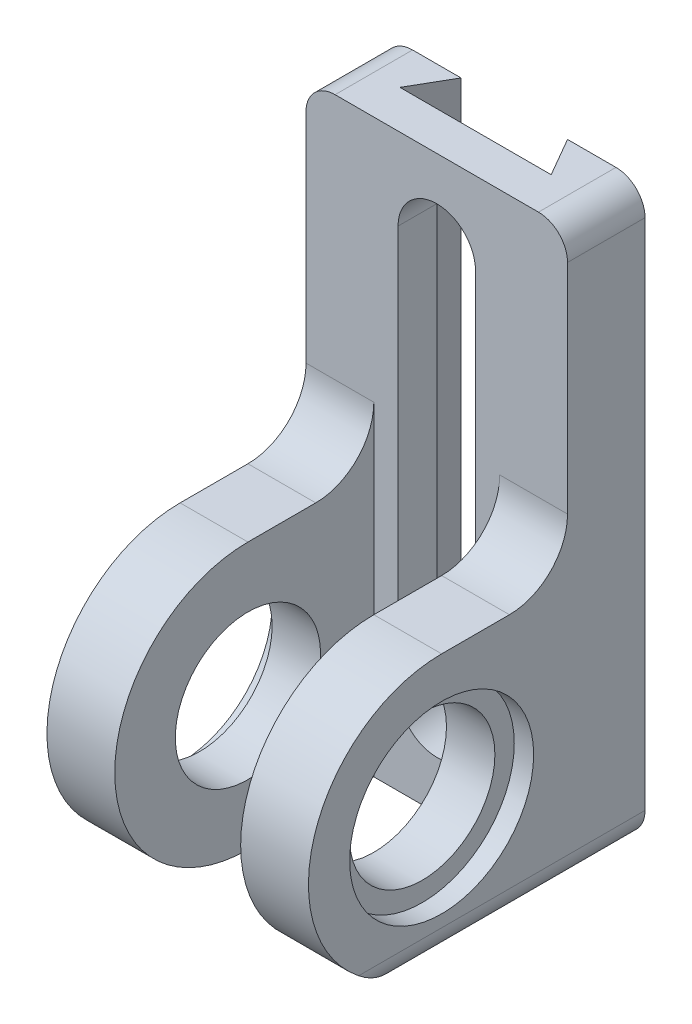
ISO-10303-21;
HEADER;
FILE_DESCRIPTION(('STEP AP214'),'2;1');
FILE_NAME('part.step','',(''),(''),'','','');
FILE_SCHEMA(('AUTOMOTIVE_DESIGN { 1 0 10303 214 1 1 1 1 }'));
ENDSEC;
DATA;
#1=APPLICATION_CONTEXT('core data for automotive mechanical design processes');
#2=APPLICATION_PROTOCOL_DEFINITION('international standard','automotive_design',2000,#1);
#3=PRODUCT_CONTEXT('',#1,'mechanical');
#4=PRODUCT('Part','Part','',(#3));
#5=PRODUCT_RELATED_PRODUCT_CATEGORY('part','',(#4));
#6=PRODUCT_DEFINITION_FORMATION('','',#4);
#7=PRODUCT_DEFINITION_CONTEXT('part definition',#1,'design');
#8=PRODUCT_DEFINITION('design','',#6,#7);
#9=PRODUCT_DEFINITION_SHAPE('','',#8);
#10=(LENGTH_UNIT() NAMED_UNIT(*) SI_UNIT(.MILLI.,.METRE.));
#11=(NAMED_UNIT(*) PLANE_ANGLE_UNIT() SI_UNIT($,.RADIAN.));
#12=(NAMED_UNIT(*) SI_UNIT($,.STERADIAN.) SOLID_ANGLE_UNIT());
#13=UNCERTAINTY_MEASURE_WITH_UNIT(LENGTH_MEASURE(1.E-05),#10,'distance_accuracy_value','');
#14=(GEOMETRIC_REPRESENTATION_CONTEXT(3) GLOBAL_UNCERTAINTY_ASSIGNED_CONTEXT((#13)) GLOBAL_UNIT_ASSIGNED_CONTEXT((#10,
#11,#12)) REPRESENTATION_CONTEXT('',''));
#15=CARTESIAN_POINT('',(0.,0.,0.));
#16=DIRECTION('',(0.,0.,1.));
#17=DIRECTION('',(1.,0.,0.));
#18=AXIS2_PLACEMENT_3D('',#15,#16,#17);
#19=CARTESIAN_POINT('',(-27.,118.,0.));
#20=DIRECTION('',(0.,0.,-1.));
#21=DIRECTION('',(0.,1.,0.));
#22=AXIS2_PLACEMENT_3D('',#19,#20,#21);
#23=PLANE('',#22);
#24=DIRECTION('',(1.,0.,0.));
#25=VECTOR('',#24,1.);
#26=CARTESIAN_POINT('',(-27.,118.,0.));
#27=LINE('',#26,#25);
#28=CARTESIAN_POINT('',(-16.,118.,0.));
#29=VERTEX_POINT('',#28);
#30=CARTESIAN_POINT('',(-6.,118.,0.));
#31=VERTEX_POINT('',#30);
#32=EDGE_CURVE('E361',#29,#31,#27,.T.);
#33=ORIENTED_EDGE('',*,*,#32,.T.);
#34=CARTESIAN_POINT('',(-6.,112.,0.));
#35=DIRECTION('',(0.,0.,-1.));
#36=DIRECTION('',(0.,1.,0.));
#37=AXIS2_PLACEMENT_3D('',#34,#35,#36);
#38=CIRCLE('',#37,6.);
#39=CARTESIAN_POINT('',(0.,112.,0.));
#40=VERTEX_POINT('',#39);
#41=EDGE_CURVE('E447',#31,#40,#38,.T.);
#42=ORIENTED_EDGE('',*,*,#41,.T.);
#43=DIRECTION('',(0.,1.,0.));
#44=VECTOR('',#43,1.);
#45=CARTESIAN_POINT('',(0.,118.,0.));
#46=LINE('',#45,#44);
#47=CARTESIAN_POINT('',(0.,6.00000000000001,0.));
#48=VERTEX_POINT('',#47);
#49=EDGE_CURVE('E347',#48,#40,#46,.T.);
#50=ORIENTED_EDGE('',*,*,#49,.F.);
#51=CARTESIAN_POINT('',(-6.,6.,0.));
#52=DIRECTION('',(0.,0.,-1.));
#53=DIRECTION('',(0.,1.,0.));
#54=AXIS2_PLACEMENT_3D('',#51,#52,#53);
#55=CIRCLE('',#54,6.);
#56=CARTESIAN_POINT('',(-6.,0.,0.));
#57=VERTEX_POINT('',#56);
#58=EDGE_CURVE('E397',#48,#57,#55,.T.);
#59=ORIENTED_EDGE('',*,*,#58,.T.);
#60=DIRECTION('',(1.,0.,0.));
#61=VECTOR('',#60,1.);
#62=CARTESIAN_POINT('',(-27.,0.,0.));
#63=LINE('',#62,#61);
#64=CARTESIAN_POINT('',(-16.,0.,0.));
#65=VERTEX_POINT('',#64);
#66=EDGE_CURVE('E362',#65,#57,#63,.T.);
#67=ORIENTED_EDGE('',*,*,#66,.F.);
#68=DIRECTION('',(0.,1.,0.));
#69=VECTOR('',#68,1.);
#70=CARTESIAN_POINT('',(-16.,-174.478016165361,0.));
#71=LINE('',#70,#69);
#72=EDGE_CURVE('E315',#65,#29,#71,.T.);
#73=ORIENTED_EDGE('',*,*,#72,.T.);
#74=EDGE_LOOP('',(#33,#42,#50,#59,#67,#73));
#75=FACE_BOUND('',#74,.T.);
#76=ADVANCED_FACE('F43',(#75),#23,.T.);
#77=CARTESIAN_POINT('',(-27.,0.,0.));
#78=DIRECTION('',(0.,-1.,0.));
#79=DIRECTION('',(0.,0.,-1.));
#80=AXIS2_PLACEMENT_3D('',#77,#78,#79);
#81=PLANE('',#80);
#82=DIRECTION('',(-1.,0.,0.));
#83=VECTOR('',#82,1.);
#84=CARTESIAN_POINT('',(-27.,0.,42.));
#85=LINE('',#84,#83);
#86=CARTESIAN_POINT('',(-40.,0.,42.));
#87=VERTEX_POINT('',#86);
#88=CARTESIAN_POINT('',(-48.,0.,42.));
#89=VERTEX_POINT('',#88);
#90=EDGE_CURVE('E295',#87,#89,#85,.T.);
#91=ORIENTED_EDGE('',*,*,#90,.T.);
#92=DIRECTION('',(0.,0.,-1.));
#93=VECTOR('',#92,1.);
#94=CARTESIAN_POINT('',(-48.,0.,0.));
#95=LINE('',#94,#93);
#96=CARTESIAN_POINT('',(-48.,0.,0.));
#97=VERTEX_POINT('',#96);
#98=EDGE_CURVE('E57',#89,#97,#95,.T.);
#99=ORIENTED_EDGE('',*,*,#98,.T.);
#100=DIRECTION('',(-1.,0.,0.));
#101=VECTOR('',#100,1.);
#102=CARTESIAN_POINT('',(-27.,0.,0.));
#103=LINE('',#102,#101);
#104=CARTESIAN_POINT('',(-38.,0.,0.));
#105=VERTEX_POINT('',#104);
#106=EDGE_CURVE('E291',#105,#97,#103,.T.);
#107=ORIENTED_EDGE('',*,*,#106,.F.);
#108=DIRECTION('',(0.499999999999998,0.,-0.86602540378444));
#109=VECTOR('',#108,1.);
#110=CARTESIAN_POINT('',(-35.25,0.,-4.7631397208144));
#111=LINE('',#110,#109);
#112=CARTESIAN_POINT('',(-42.618802153517,0.,8.));
#113=VERTEX_POINT('',#112);
#114=EDGE_CURVE('E252',#113,#105,#111,.T.);
#115=ORIENTED_EDGE('',*,*,#114,.F.);
#116=DIRECTION('',(1.,0.,0.));
#117=VECTOR('',#116,1.);
#118=CARTESIAN_POINT('',(-27.,0.,8.));
#119=LINE('',#118,#117);
#120=CARTESIAN_POINT('',(-11.381197846483,0.,8.));
#121=VERTEX_POINT('',#120);
#122=EDGE_CURVE('E318',#113,#121,#119,.T.);
#123=ORIENTED_EDGE('',*,*,#122,.T.);
#124=DIRECTION('',(-0.499999999999998,0.,-0.86602540378444));
#125=VECTOR('',#124,1.);
#126=CARTESIAN_POINT('',(-18.75,0.,-4.7631397208144));
#127=LINE('',#126,#125);
#128=EDGE_CURVE('E321',#121,#65,#127,.T.);
#129=ORIENTED_EDGE('',*,*,#128,.T.);
#130=ORIENTED_EDGE('',*,*,#66,.T.);
#131=DIRECTION('',(0.,0.,-1.));
#132=VECTOR('',#131,1.);
#133=CARTESIAN_POINT('',(-6.,0.,42.));
#134=LINE('',#133,#132);
#135=CARTESIAN_POINT('',(-6.,0.,42.));
#136=VERTEX_POINT('',#135);
#137=EDGE_CURVE('E399',#57,#136,#134,.F.);
#138=ORIENTED_EDGE('',*,*,#137,.T.);
#139=DIRECTION('',(1.,0.,0.));
#140=VECTOR('',#139,1.);
#141=CARTESIAN_POINT('',(-27.,0.,42.));
#142=LINE('',#141,#140);
#143=CARTESIAN_POINT('',(-14.,0.,42.));
#144=VERTEX_POINT('',#143);
#145=EDGE_CURVE('E366',#144,#136,#142,.T.);
#146=ORIENTED_EDGE('',*,*,#145,.F.);
#147=DIRECTION('',(0.,0.,1.));
#148=VECTOR('',#147,1.);
#149=CARTESIAN_POINT('',(-14.,0.,69.5));
#150=LINE('',#149,#148);
#151=CARTESIAN_POINT('',(-14.,0.,16.));
#152=VERTEX_POINT('',#151);
#153=EDGE_CURVE('E327',#152,#144,#150,.T.);
#154=ORIENTED_EDGE('',*,*,#153,.F.);
#155=DIRECTION('',(1.,0.,0.));
#156=VECTOR('',#155,1.);
#157=CARTESIAN_POINT('',(-14.,0.,16.));
#158=LINE('',#157,#156);
#159=CARTESIAN_POINT('',(-40.,0.,16.));
#160=VERTEX_POINT('',#159);
#161=EDGE_CURVE('E324',#160,#152,#158,.T.);
#162=ORIENTED_EDGE('',*,*,#161,.F.);
#163=DIRECTION('',(0.,0.,1.));
#164=VECTOR('',#163,1.);
#165=CARTESIAN_POINT('',(-40.,0.,69.5));
#166=LINE('',#165,#164);
#167=EDGE_CURVE('E254',#160,#87,#166,.T.);
#168=ORIENTED_EDGE('',*,*,#167,.T.);
#169=EDGE_LOOP('',(#91,#99,#107,#115,#123,#129,#130,#138,#146,#154,#162,#168));
#170=FACE_BOUND('',#169,.T.);
#171=ADVANCED_FACE('F423',(#170),#81,.T.);
#172=CARTESIAN_POINT('',(-27.,118.,16.));
#173=DIRECTION('',(0.,1.,0.));
#174=DIRECTION('',(0.,0.,1.));
#175=AXIS2_PLACEMENT_3D('',#172,#173,#174);
#176=PLANE('',#175);
#177=DIRECTION('',(1.,0.,0.));
#178=VECTOR('',#177,1.);
#179=CARTESIAN_POINT('',(-27.,118.,16.));
#180=LINE('',#179,#178);
#181=CARTESIAN_POINT('',(-48.,118.,16.));
#182=VERTEX_POINT('',#181);
#183=CARTESIAN_POINT('',(-6.,118.,16.));
#184=VERTEX_POINT('',#183);
#185=EDGE_CURVE('E376',#182,#184,#180,.T.);
#186=ORIENTED_EDGE('',*,*,#185,.T.);
#187=DIRECTION('',(0.,0.,1.));
#188=VECTOR('',#187,1.);
#189=CARTESIAN_POINT('',(-6.,118.,0.));
#190=LINE('',#189,#188);
#191=EDGE_CURVE('E453',#184,#31,#190,.F.);
#192=ORIENTED_EDGE('',*,*,#191,.T.);
#193=ORIENTED_EDGE('',*,*,#32,.F.);
#194=DIRECTION('',(0.499999999999998,0.,0.86602540378444));
#195=VECTOR('',#194,1.);
#196=CARTESIAN_POINT('',(-11.8217967697245,118.,7.23686027918564));
#197=LINE('',#196,#195);
#198=CARTESIAN_POINT('',(-11.381197846483,118.,8.));
#199=VERTEX_POINT('',#198);
#200=EDGE_CURVE('E384',#29,#199,#197,.T.);
#201=ORIENTED_EDGE('',*,*,#200,.T.);
#202=DIRECTION('',(-1.,0.,0.));
#203=VECTOR('',#202,1.);
#204=CARTESIAN_POINT('',(-27.,118.,8.));
#205=LINE('',#204,#203);
#206=CARTESIAN_POINT('',(-42.618802153517,118.,8.));
#207=VERTEX_POINT('',#206);
#208=EDGE_CURVE('E365',#199,#207,#205,.T.);
#209=ORIENTED_EDGE('',*,*,#208,.T.);
#210=DIRECTION('',(-0.499999999999998,0.,0.86602540378444));
#211=VECTOR('',#210,1.);
#212=CARTESIAN_POINT('',(-42.1782032302755,118.,7.23686027918564));
#213=LINE('',#212,#211);
#214=CARTESIAN_POINT('',(-38.,118.,0.));
#215=VERTEX_POINT('',#214);
#216=EDGE_CURVE('E294',#215,#207,#213,.T.);
#217=ORIENTED_EDGE('',*,*,#216,.F.);
#218=DIRECTION('',(-1.,0.,0.));
#219=VECTOR('',#218,1.);
#220=CARTESIAN_POINT('',(-27.,118.,0.));
#221=LINE('',#220,#219);
#222=CARTESIAN_POINT('',(-48.,118.,0.));
#223=VERTEX_POINT('',#222);
#224=EDGE_CURVE('E290',#215,#223,#221,.T.);
#225=ORIENTED_EDGE('',*,*,#224,.T.);
#226=DIRECTION('',(0.,0.,1.));
#227=VECTOR('',#226,1.);
#228=CARTESIAN_POINT('',(-48.,118.,16.));
#229=LINE('',#228,#227);
#230=EDGE_CURVE('E459',#223,#182,#229,.T.);
#231=ORIENTED_EDGE('',*,*,#230,.T.);
#232=EDGE_LOOP('',(#186,#192,#193,#201,#209,#217,#225,#231));
#233=FACE_BOUND('',#232,.T.);
#234=ADVANCED_FACE('F421',(#233),#176,.T.);
#235=CARTESIAN_POINT('',(-27.,27.5,42.));
#236=DIRECTION('',(1.,0.,0.));
#237=DIRECTION('',(0.,0.,-1.));
#238=AXIS2_PLACEMENT_3D('',#235,#236,#237);
#239=CYLINDRICAL_SURFACE('',#238,27.5);
#240=ORIENTED_EDGE('',*,*,#145,.T.);
#241=CARTESIAN_POINT('',(0.,6.,59.1464281994822));
#242=CARTESIAN_POINT('',(-1.19597853242227E-05,5.86323878730196,58.97495101779));
#243=CARTESIAN_POINT('',(-0.00467529896430748,5.72855872475506,58.8018582369554));
#244=CARTESIAN_POINT('',(-0.0225463443197351,5.46361802526845,58.452834998014));
#245=CARTESIAN_POINT('',(-0.0357513908478061,5.33335602595039,58.2769054398211));
#246=CARTESIAN_POINT('',(-0.0699166637892913,5.07766075818884,57.9228239978805));
#247=CARTESIAN_POINT('',(-0.0908624469045142,4.95221897400261,57.7446768463461));
#248=CARTESIAN_POINT('',(-0.139845304495458,4.7060380923147,57.386117357111));
#249=CARTESIAN_POINT('',(-0.167882996086804,4.58529940511743,57.2057048235829));
#250=CARTESIAN_POINT('',(-0.261235831958719,4.23204791656502,56.664146734316));
#251=CARTESIAN_POINT('',(-0.336067969836736,4.00657026723381,56.3000046090538));
#252=CARTESIAN_POINT('',(-0.50707465599253,3.57477229467483,55.5652233098904));
#253=CARTESIAN_POINT('',(-0.603263251076297,3.36846470746709,55.1945800084232));
#254=CARTESIAN_POINT('',(-0.792760824505874,3.01391692878088,54.5218370608529));
#255=CARTESIAN_POINT('',(-0.882896203650564,2.86224929687171,54.2206361009054));
#256=CARTESIAN_POINT('',(-1.0731676129327,2.57121844152793,53.615447460908));
#257=CARTESIAN_POINT('',(-1.17330479950031,2.43185664443787,53.3114594623136));
#258=CARTESIAN_POINT('',(-1.48672752247981,2.03197840283151,52.3958418830382));
#259=CARTESIAN_POINT('',(-1.71301181640983,1.78969154316575,51.7806014822474));
#260=CARTESIAN_POINT('',(-2.19231972925325,1.35162094120064,50.5408760535597));
#261=CARTESIAN_POINT('',(-2.44545564583231,1.15604458925087,49.9163624120902));
#262=CARTESIAN_POINT('',(-2.97062201326019,0.811410038835711,48.6627024223054));
#263=CARTESIAN_POINT('',(-3.24264750501392,0.66233968713846,48.0335573283739));
#264=CARTESIAN_POINT('',(-3.71830265792247,0.446562752839289,46.956668199771));
#265=CARTESIAN_POINT('',(-3.91865814130805,0.368519014404475,46.5097049741419));
#266=CARTESIAN_POINT('',(-4.32417105559603,0.234829391350376,45.6145977867268));
#267=CARTESIAN_POINT('',(-4.52932911350089,0.179186448729744,45.1664536776244));
#268=CARTESIAN_POINT('',(-5.14852764470595,0.0457593390690001,43.8229802428915));
#269=CARTESIAN_POINT('',(-5.56737808048158,0.000995422478633021,42.9261891461037));
#270=CARTESIAN_POINT('',(-5.99064257321795,5.47503479598994E-06,42.0200330593041));
#271=CARTESIAN_POINT('',(-5.99532130781622,2.54524829043168E-09,42.0100164871249));
#272=CARTESIAN_POINT('',(-6.,0.,42.));
#273=B_SPLINE_CURVE_WITH_KNOTS('',3,(#241,#242,#243,#244,#245,#246,#247,#248,#249,#250,#251,
#252,#253,#254,#255,#256,#257,#258,#259,#260,#261,#262,#263,#264,#265,#266,#267,#268,#269,#270,
#271,#272),.UNSPECIFIED.,.F.,.F.,(4,2,2,2,2,2,2,2,2,2,2,2,2,2,2,4),(0.,0.657890898774864,
1.31557704729753,1.97204217668188,2.62856444926567,3.93170367743565,5.23570257337212,
6.28251967573983,7.32945795373697,9.42348355749168,11.5266404473413,13.6292472661182,
15.1166915318322,16.6043310867035,19.5715482270689,19.604714479038),.UNSPECIFIED.);
#274=CARTESIAN_POINT('',(0.,6.,59.1464281994822));
#275=VERTEX_POINT('',#274);
#276=EDGE_CURVE('E401',#136,#275,#273,.F.);
#277=ORIENTED_EDGE('',*,*,#276,.T.);
#278=CARTESIAN_POINT('',(0.,27.5,42.));
#279=DIRECTION('',(1.,0.,0.));
#280=DIRECTION('',(0.,0.,1.));
#281=AXIS2_PLACEMENT_3D('',#278,#279,#280);
#282=CIRCLE('',#281,27.5);
#283=CARTESIAN_POINT('',(0.,55.,42.));
#284=VERTEX_POINT('',#283);
#285=EDGE_CURVE('E358',#284,#275,#282,.T.);
#286=ORIENTED_EDGE('',*,*,#285,.F.);
#287=DIRECTION('',(1.,0.,0.));
#288=VECTOR('',#287,1.);
#289=CARTESIAN_POINT('',(-27.,55.,42.));
#290=LINE('',#289,#288);
#291=CARTESIAN_POINT('',(-14.,55.,42.));
#292=VERTEX_POINT('',#291);
#293=EDGE_CURVE('E369',#292,#284,#290,.T.);
#294=ORIENTED_EDGE('',*,*,#293,.F.);
#295=CARTESIAN_POINT('',(-14.,27.5,42.));
#296=DIRECTION('',(1.,0.,0.));
#297=DIRECTION('',(0.,0.,-1.));
#298=AXIS2_PLACEMENT_3D('',#295,#296,#297);
#299=CIRCLE('',#298,27.5);
#300=EDGE_CURVE('E336',#144,#292,#299,.F.);
#301=ORIENTED_EDGE('',*,*,#300,.F.);
#302=EDGE_LOOP('',(#240,#277,#286,#294,#301));
#303=FACE_BOUND('',#302,.T.);
#304=ADVANCED_FACE('F415',(#303),#239,.T.);
#305=CARTESIAN_POINT('',(-27.,55.,42.));
#306=DIRECTION('',(0.,1.,0.));
#307=DIRECTION('',(0.,0.,1.));
#308=AXIS2_PLACEMENT_3D('',#305,#306,#307);
#309=PLANE('',#308);
#310=DIRECTION('',(0.,0.,-1.));
#311=VECTOR('',#310,1.);
#312=CARTESIAN_POINT('',(-14.,55.,42.));
#313=LINE('',#312,#311);
#314=CARTESIAN_POINT('',(-14.,55.,28.0000000000001));
#315=VERTEX_POINT('',#314);
#316=EDGE_CURVE('E334',#292,#315,#313,.T.);
#317=ORIENTED_EDGE('',*,*,#316,.F.);
#318=ORIENTED_EDGE('',*,*,#293,.T.);
#319=DIRECTION('',(0.,0.,1.));
#320=VECTOR('',#319,1.);
#321=CARTESIAN_POINT('',(0.,55.,42.));
#322=LINE('',#321,#320);
#323=CARTESIAN_POINT('',(0.,55.,28.0000000000001));
#324=VERTEX_POINT('',#323);
#325=EDGE_CURVE('E355',#324,#284,#322,.T.);
#326=ORIENTED_EDGE('',*,*,#325,.F.);
#327=DIRECTION('',(1.,0.,0.));
#328=VECTOR('',#327,1.);
#329=CARTESIAN_POINT('',(-27.,55.,28.0000000000001));
#330=LINE('',#329,#328);
#331=EDGE_CURVE('E371',#315,#324,#330,.T.);
#332=ORIENTED_EDGE('',*,*,#331,.F.);
#333=EDGE_LOOP('',(#317,#318,#326,#332));
#334=FACE_BOUND('',#333,.T.);
#335=ADVANCED_FACE('F420',(#334),#309,.T.);
#336=CARTESIAN_POINT('',(-27.,67.,28.));
#337=DIRECTION('',(1.,0.,0.));
#338=DIRECTION('',(0.,0.,-1.));
#339=AXIS2_PLACEMENT_3D('',#336,#337,#338);
#340=CYLINDRICAL_SURFACE('',#339,12.);
#341=CARTESIAN_POINT('',(-14.,67.,28.));
#342=DIRECTION('',(1.,0.,0.));
#343=DIRECTION('',(0.,0.,-1.));
#344=AXIS2_PLACEMENT_3D('',#341,#342,#343);
#345=CIRCLE('',#344,12.);
#346=CARTESIAN_POINT('',(-14.,67.,16.));
#347=VERTEX_POINT('',#346);
#348=EDGE_CURVE('E332',#315,#347,#345,.T.);
#349=ORIENTED_EDGE('',*,*,#348,.F.);
#350=ORIENTED_EDGE('',*,*,#331,.T.);
#351=CARTESIAN_POINT('',(0.,67.,28.));
#352=DIRECTION('',(-1.,0.,0.));
#353=DIRECTION('',(0.,0.,-1.));
#354=AXIS2_PLACEMENT_3D('',#351,#352,#353);
#355=CIRCLE('',#354,12.);
#356=CARTESIAN_POINT('',(0.,67.,16.));
#357=VERTEX_POINT('',#356);
#358=EDGE_CURVE('E352',#357,#324,#355,.T.);
#359=ORIENTED_EDGE('',*,*,#358,.F.);
#360=DIRECTION('',(1.,0.,0.));
#361=VECTOR('',#360,1.);
#362=CARTESIAN_POINT('',(-27.,67.,16.));
#363=LINE('',#362,#361);
#364=EDGE_CURVE('E373',#347,#357,#363,.T.);
#365=ORIENTED_EDGE('',*,*,#364,.F.);
#366=EDGE_LOOP('',(#349,#350,#359,#365));
#367=FACE_BOUND('',#366,.T.);
#368=ADVANCED_FACE('F427',(#367),#340,.F.);
#369=CARTESIAN_POINT('',(-27.,67.0000000000001,16.));
#370=DIRECTION('',(0.,0.,1.));
#371=DIRECTION('',(1.,0.,0.));
#372=AXIS2_PLACEMENT_3D('',#369,#370,#371);
#373=PLANE('',#372);
#374=CARTESIAN_POINT('',(-27.,101.,16.));
#375=DIRECTION('',(0.,0.,1.));
#376=DIRECTION('',(1.,0.,0.));
#377=AXIS2_PLACEMENT_3D('',#374,#375,#376);
#378=CIRCLE('',#377,8.);
#379=CARTESIAN_POINT('',(-19.,101.,16.));
#380=VERTEX_POINT('',#379);
#381=CARTESIAN_POINT('',(-35.,101.,16.));
#382=VERTEX_POINT('',#381);
#383=EDGE_CURVE('E232',#380,#382,#378,.T.);
#384=ORIENTED_EDGE('',*,*,#383,.F.);
#385=DIRECTION('',(0.,1.,0.));
#386=VECTOR('',#385,1.);
#387=CARTESIAN_POINT('',(-19.,101.,16.));
#388=LINE('',#387,#386);
#389=CARTESIAN_POINT('',(-19.,18.,16.));
#390=VERTEX_POINT('',#389);
#391=EDGE_CURVE('E237',#390,#380,#388,.T.);
#392=ORIENTED_EDGE('',*,*,#391,.F.);
#393=CARTESIAN_POINT('',(-27.,18.,16.));
#394=DIRECTION('',(0.,0.,1.));
#395=DIRECTION('',(1.,0.,0.));
#396=AXIS2_PLACEMENT_3D('',#393,#394,#395);
#397=CIRCLE('',#396,8.);
#398=CARTESIAN_POINT('',(-35.,18.,16.));
#399=VERTEX_POINT('',#398);
#400=EDGE_CURVE('E216',#399,#390,#397,.T.);
#401=ORIENTED_EDGE('',*,*,#400,.F.);
#402=DIRECTION('',(0.,-1.,0.));
#403=VECTOR('',#402,1.);
#404=CARTESIAN_POINT('',(-35.,101.,16.));
#405=LINE('',#404,#403);
#406=EDGE_CURVE('E227',#382,#399,#405,.T.);
#407=ORIENTED_EDGE('',*,*,#406,.F.);
#408=EDGE_LOOP('',(#384,#392,#401,#407));
#409=FACE_BOUND('',#408,.T.);
#410=DIRECTION('',(0.,-1.,0.));
#411=VECTOR('',#410,1.);
#412=CARTESIAN_POINT('',(0.,67.0000000000001,16.));
#413=LINE('',#412,#411);
#414=CARTESIAN_POINT('',(0.,112.,16.));
#415=VERTEX_POINT('',#414);
#416=EDGE_CURVE('E350',#415,#357,#413,.T.);
#417=ORIENTED_EDGE('',*,*,#416,.F.);
#418=CARTESIAN_POINT('',(-6.,112.,16.));
#419=DIRECTION('',(0.,0.,1.));
#420=DIRECTION('',(1.,0.,0.));
#421=AXIS2_PLACEMENT_3D('',#418,#419,#420);
#422=CIRCLE('',#421,6.);
#423=EDGE_CURVE('E489',#415,#184,#422,.T.);
#424=ORIENTED_EDGE('',*,*,#423,.T.);
#425=ORIENTED_EDGE('',*,*,#185,.F.);
#426=CARTESIAN_POINT('',(-48.,112.,16.));
#427=DIRECTION('',(0.,0.,1.));
#428=DIRECTION('',(1.,0.,0.));
#429=AXIS2_PLACEMENT_3D('',#426,#427,#428);
#430=CIRCLE('',#429,6.);
#431=CARTESIAN_POINT('',(-54.,112.,16.));
#432=VERTEX_POINT('',#431);
#433=EDGE_CURVE('E488',#182,#432,#430,.T.);
#434=ORIENTED_EDGE('',*,*,#433,.T.);
#435=DIRECTION('',(0.,-1.,0.));
#436=VECTOR('',#435,1.);
#437=CARTESIAN_POINT('',(-54.,67.0000000000001,16.));
#438=LINE('',#437,#436);
#439=CARTESIAN_POINT('',(-54.,67.,16.));
#440=VERTEX_POINT('',#439);
#441=EDGE_CURVE('E282',#432,#440,#438,.T.);
#442=ORIENTED_EDGE('',*,*,#441,.T.);
#443=DIRECTION('',(-1.,0.,0.));
#444=VECTOR('',#443,1.);
#445=CARTESIAN_POINT('',(-27.,67.,16.));
#446=LINE('',#445,#444);
#447=CARTESIAN_POINT('',(-40.,67.,16.));
#448=VERTEX_POINT('',#447);
#449=EDGE_CURVE('E303',#448,#440,#446,.T.);
#450=ORIENTED_EDGE('',*,*,#449,.F.);
#451=DIRECTION('',(0.,-1.,0.));
#452=VECTOR('',#451,1.);
#453=CARTESIAN_POINT('',(-40.,118.,16.));
#454=LINE('',#453,#452);
#455=EDGE_CURVE('E257',#448,#160,#454,.T.);
#456=ORIENTED_EDGE('',*,*,#455,.T.);
#457=ORIENTED_EDGE('',*,*,#161,.T.);
#458=DIRECTION('',(0.,-1.,0.));
#459=VECTOR('',#458,1.);
#460=CARTESIAN_POINT('',(-14.,118.,16.));
#461=LINE('',#460,#459);
#462=EDGE_CURVE('E329',#347,#152,#461,.T.);
#463=ORIENTED_EDGE('',*,*,#462,.F.);
#464=ORIENTED_EDGE('',*,*,#364,.T.);
#465=EDGE_LOOP('',(#417,#424,#425,#434,#442,#450,#456,#457,#463,#464));
#466=FACE_BOUND('',#465,.T.);
#467=ADVANCED_FACE('F234',(#409,#466),#373,.T.);
#468=CARTESIAN_POINT('',(0.,27.5,42.));
#469=DIRECTION('',(-1.,0.,0.));
#470=DIRECTION('',(0.,0.,1.));
#471=AXIS2_PLACEMENT_3D('',#468,#469,#470);
#472=PLANE('',#471);
#473=CARTESIAN_POINT('',(0.,27.5,42.));
#474=DIRECTION('',(1.,0.,0.));
#475=DIRECTION('',(0.,0.,-1.));
#476=AXIS2_PLACEMENT_3D('',#473,#474,#475);
#477=CIRCLE('',#476,19.);
#478=CARTESIAN_POINT('',(0.,27.5,23.));
#479=VERTEX_POINT('',#478);
#480=EDGE_CURVE('E338',#479,#479,#477,.T.);
#481=ORIENTED_EDGE('',*,*,#480,.F.);
#482=EDGE_LOOP('',(#481));
#483=FACE_BOUND('',#482,.T.);
#484=ORIENTED_EDGE('',*,*,#49,.T.);
#485=DIRECTION('',(0.,0.,1.));
#486=VECTOR('',#485,1.);
#487=CARTESIAN_POINT('',(0.,112.,16.));
#488=LINE('',#487,#486);
#489=EDGE_CURVE('E409',#40,#415,#488,.T.);
#490=ORIENTED_EDGE('',*,*,#489,.T.);
#491=ORIENTED_EDGE('',*,*,#416,.T.);
#492=ORIENTED_EDGE('',*,*,#358,.T.);
#493=ORIENTED_EDGE('',*,*,#325,.T.);
#494=ORIENTED_EDGE('',*,*,#285,.T.);
#495=DIRECTION('',(0.,0.,-1.));
#496=VECTOR('',#495,1.);
#497=CARTESIAN_POINT('',(0.,6.,0.));
#498=LINE('',#497,#496);
#499=EDGE_CURVE('E394',#275,#48,#498,.T.);
#500=ORIENTED_EDGE('',*,*,#499,.T.);
#501=EDGE_LOOP('',(#484,#490,#491,#492,#493,#494,#500));
#502=FACE_BOUND('',#501,.T.);
#503=ADVANCED_FACE('F434',(#483,#502),#472,.F.);
#504=CARTESIAN_POINT('',(0.,27.5,42.));
#505=DIRECTION('',(1.,0.,0.));
#506=DIRECTION('',(0.,0.,-1.));
#507=AXIS2_PLACEMENT_3D('',#504,#505,#506);
#508=CYLINDRICAL_SURFACE('',#507,15.);
#509=CARTESIAN_POINT('',(-14.,27.5,42.));
#510=DIRECTION('',(1.,0.,0.));
#511=DIRECTION('',(0.,0.,-1.));
#512=AXIS2_PLACEMENT_3D('',#509,#510,#511);
#513=CIRCLE('',#512,15.);
#514=CARTESIAN_POINT('',(-14.,27.5,27.));
#515=VERTEX_POINT('',#514);
#516=EDGE_CURVE('E331',#515,#515,#513,.F.);
#517=ORIENTED_EDGE('',*,*,#516,.T.);
#518=EDGE_LOOP('',(#517));
#519=FACE_BOUND('',#518,.T.);
#520=CARTESIAN_POINT('',(-4.,27.5,42.));
#521=DIRECTION('',(1.,0.,0.));
#522=DIRECTION('',(0.,0.,-1.));
#523=AXIS2_PLACEMENT_3D('',#520,#521,#522);
#524=CIRCLE('',#523,15.);
#525=CARTESIAN_POINT('',(-4.,27.5,27.));
#526=VERTEX_POINT('',#525);
#527=EDGE_CURVE('E344',#526,#526,#524,.T.);
#528=ORIENTED_EDGE('',*,*,#527,.T.);
#529=EDGE_LOOP('',(#528));
#530=FACE_BOUND('',#529,.T.);
#531=ADVANCED_FACE('F554',(#519,#530),#508,.F.);
#532=CARTESIAN_POINT('',(-4.,42.5,42.));
#533=DIRECTION('',(-1.,0.,0.));
#534=DIRECTION('',(0.,0.,1.));
#535=AXIS2_PLACEMENT_3D('',#532,#533,#534);
#536=PLANE('',#535);
#537=ORIENTED_EDGE('',*,*,#527,.F.);
#538=EDGE_LOOP('',(#537));
#539=FACE_BOUND('',#538,.T.);
#540=CARTESIAN_POINT('',(-4.,27.5,42.));
#541=DIRECTION('',(1.,0.,0.));
#542=DIRECTION('',(0.,0.,-1.));
#543=AXIS2_PLACEMENT_3D('',#540,#541,#542);
#544=CIRCLE('',#543,19.);
#545=CARTESIAN_POINT('',(-4.,27.5,23.));
#546=VERTEX_POINT('',#545);
#547=EDGE_CURVE('E341',#546,#546,#544,.T.);
#548=ORIENTED_EDGE('',*,*,#547,.T.);
#549=EDGE_LOOP('',(#548));
#550=FACE_BOUND('',#549,.T.);
#551=ADVANCED_FACE('F550',(#539,#550),#536,.F.);
#552=CARTESIAN_POINT('',(0.,27.5,42.));
#553=DIRECTION('',(1.,0.,0.));
#554=DIRECTION('',(0.,0.,-1.));
#555=AXIS2_PLACEMENT_3D('',#552,#553,#554);
#556=CYLINDRICAL_SURFACE('',#555,19.);
#557=ORIENTED_EDGE('',*,*,#547,.F.);
#558=EDGE_LOOP('',(#557));
#559=FACE_BOUND('',#558,.T.);
#560=ORIENTED_EDGE('',*,*,#480,.T.);
#561=EDGE_LOOP('',(#560));
#562=FACE_BOUND('',#561,.T.);
#563=ADVANCED_FACE('F547',(#559,#562),#556,.F.);
#564=CARTESIAN_POINT('',(-14.,118.,69.5));
#565=DIRECTION('',(1.,0.,0.));
#566=DIRECTION('',(0.,0.,-1.));
#567=AXIS2_PLACEMENT_3D('',#564,#565,#566);
#568=PLANE('',#567);
#569=ORIENTED_EDGE('',*,*,#300,.T.);
#570=ORIENTED_EDGE('',*,*,#316,.T.);
#571=ORIENTED_EDGE('',*,*,#348,.T.);
#572=ORIENTED_EDGE('',*,*,#462,.T.);
#573=ORIENTED_EDGE('',*,*,#153,.T.);
#574=EDGE_LOOP('',(#569,#570,#571,#572,#573));
#575=FACE_BOUND('',#574,.T.);
#576=ORIENTED_EDGE('',*,*,#516,.F.);
#577=EDGE_LOOP('',(#576));
#578=FACE_BOUND('',#577,.T.);
#579=ADVANCED_FACE('F511',(#575,#578),#568,.F.);
#580=CARTESIAN_POINT('',(-16.,-174.478016165361,0.));
#581=DIRECTION('',(-0.86602540378444,0.,0.499999999999998));
#582=DIRECTION('',(0.499999999999998,0.,0.86602540378444));
#583=AXIS2_PLACEMENT_3D('',#580,#581,#582);
#584=PLANE('',#583);
#585=ORIENTED_EDGE('',*,*,#128,.F.);
#586=DIRECTION('',(0.,1.,0.));
#587=VECTOR('',#586,1.);
#588=CARTESIAN_POINT('',(-11.381197846483,-174.478016165361,8.));
#589=LINE('',#588,#587);
#590=EDGE_CURVE('E312',#121,#199,#589,.T.);
#591=ORIENTED_EDGE('',*,*,#590,.T.);
#592=ORIENTED_EDGE('',*,*,#200,.F.);
#593=ORIENTED_EDGE('',*,*,#72,.F.);
#594=EDGE_LOOP('',(#585,#591,#592,#593));
#595=FACE_BOUND('',#594,.T.);
#596=ADVANCED_FACE('F480',(#595),#584,.T.);
#597=CARTESIAN_POINT('',(-11.381197846483,-174.478016165361,8.));
#598=DIRECTION('',(0.,0.,-1.));
#599=DIRECTION('',(-1.,0.,0.));
#600=AXIS2_PLACEMENT_3D('',#597,#598,#599);
#601=PLANE('',#600);
#602=CARTESIAN_POINT('',(-27.,101.,8.));
#603=DIRECTION('',(0.,0.,-1.));
#604=DIRECTION('',(-1.,0.,0.));
#605=AXIS2_PLACEMENT_3D('',#602,#603,#604);
#606=CIRCLE('',#605,8.);
#607=CARTESIAN_POINT('',(-35.,101.,8.00000000000001));
#608=VERTEX_POINT('',#607);
#609=CARTESIAN_POINT('',(-19.,101.,8.));
#610=VERTEX_POINT('',#609);
#611=EDGE_CURVE('E392',#608,#610,#606,.T.);
#612=ORIENTED_EDGE('',*,*,#611,.F.);
#613=DIRECTION('',(0.,1.,0.));
#614=VECTOR('',#613,1.);
#615=CARTESIAN_POINT('',(-35.,-174.478016165361,8.00000000000001));
#616=LINE('',#615,#614);
#617=CARTESIAN_POINT('',(-35.,18.,8.00000000000001));
#618=VERTEX_POINT('',#617);
#619=EDGE_CURVE('E387',#618,#608,#616,.T.);
#620=ORIENTED_EDGE('',*,*,#619,.F.);
#621=CARTESIAN_POINT('',(-27.,18.,8.));
#622=DIRECTION('',(0.,0.,-1.));
#623=DIRECTION('',(-1.,0.,0.));
#624=AXIS2_PLACEMENT_3D('',#621,#622,#623);
#625=CIRCLE('',#624,8.);
#626=CARTESIAN_POINT('',(-19.,18.,8.00000000000001));
#627=VERTEX_POINT('',#626);
#628=EDGE_CURVE('E219',#627,#618,#625,.T.);
#629=ORIENTED_EDGE('',*,*,#628,.F.);
#630=DIRECTION('',(0.,-1.,0.));
#631=VECTOR('',#630,1.);
#632=CARTESIAN_POINT('',(-19.,-174.478016165361,8.));
#633=LINE('',#632,#631);
#634=EDGE_CURVE('E390',#610,#627,#633,.T.);
#635=ORIENTED_EDGE('',*,*,#634,.F.);
#636=EDGE_LOOP('',(#612,#620,#629,#635));
#637=FACE_BOUND('',#636,.T.);
#638=ORIENTED_EDGE('',*,*,#122,.F.);
#639=DIRECTION('',(0.,1.,0.));
#640=VECTOR('',#639,1.);
#641=CARTESIAN_POINT('',(-42.618802153517,-174.478016165361,8.));
#642=LINE('',#641,#640);
#643=EDGE_CURVE('E244',#113,#207,#642,.T.);
#644=ORIENTED_EDGE('',*,*,#643,.T.);
#645=ORIENTED_EDGE('',*,*,#208,.F.);
#646=ORIENTED_EDGE('',*,*,#590,.F.);
#647=EDGE_LOOP('',(#638,#644,#645,#646));
#648=FACE_BOUND('',#647,.T.);
#649=ADVANCED_FACE('F478',(#637,#648),#601,.T.);
#650=CARTESIAN_POINT('',(-27.,118.,0.));
#651=DIRECTION('',(0.,0.,-1.));
#652=DIRECTION('',(0.,1.,0.));
#653=AXIS2_PLACEMENT_3D('',#650,#651,#652);
#654=PLANE('',#653);
#655=DIRECTION('',(0.,1.,0.));
#656=VECTOR('',#655,1.);
#657=CARTESIAN_POINT('',(-54.,118.,0.));
#658=LINE('',#657,#656);
#659=CARTESIAN_POINT('',(-54.,6.00000000000001,0.));
#660=VERTEX_POINT('',#659);
#661=CARTESIAN_POINT('',(-54.,112.,0.));
#662=VERTEX_POINT('',#661);
#663=EDGE_CURVE('E279',#660,#662,#658,.T.);
#664=ORIENTED_EDGE('',*,*,#663,.T.);
#665=CARTESIAN_POINT('',(-48.,112.,0.));
#666=DIRECTION('',(0.,0.,-1.));
#667=DIRECTION('',(0.,1.,0.));
#668=AXIS2_PLACEMENT_3D('',#665,#666,#667);
#669=CIRCLE('',#668,6.);
#670=EDGE_CURVE('E465',#662,#223,#669,.T.);
#671=ORIENTED_EDGE('',*,*,#670,.T.);
#672=ORIENTED_EDGE('',*,*,#224,.F.);
#673=DIRECTION('',(0.,1.,0.));
#674=VECTOR('',#673,1.);
#675=CARTESIAN_POINT('',(-38.,-174.478016165361,0.));
#676=LINE('',#675,#674);
#677=EDGE_CURVE('E249',#105,#215,#676,.T.);
#678=ORIENTED_EDGE('',*,*,#677,.F.);
#679=ORIENTED_EDGE('',*,*,#106,.T.);
#680=CARTESIAN_POINT('',(-48.,6.,0.));
#681=DIRECTION('',(0.,0.,-1.));
#682=DIRECTION('',(0.,1.,0.));
#683=AXIS2_PLACEMENT_3D('',#680,#681,#682);
#684=CIRCLE('',#683,6.);
#685=EDGE_CURVE('E70',#97,#660,#684,.T.);
#686=ORIENTED_EDGE('',*,*,#685,.T.);
#687=EDGE_LOOP('',(#664,#671,#672,#678,#679,#686));
#688=FACE_BOUND('',#687,.T.);
#689=ADVANCED_FACE('F470',(#688),#654,.T.);
#690=CARTESIAN_POINT('',(-27.,27.5,42.));
#691=DIRECTION('',(-1.,0.,0.));
#692=DIRECTION('',(0.,0.,-1.));
#693=AXIS2_PLACEMENT_3D('',#690,#691,#692);
#694=CYLINDRICAL_SURFACE('',#693,27.5);
#695=CARTESIAN_POINT('',(-54.,27.5,42.));
#696=DIRECTION('',(1.,0.,0.));
#697=DIRECTION('',(0.,0.,1.));
#698=AXIS2_PLACEMENT_3D('',#695,#696,#697);
#699=CIRCLE('',#698,27.5);
#700=CARTESIAN_POINT('',(-54.,55.,42.));
#701=VERTEX_POINT('',#700);
#702=CARTESIAN_POINT('',(-54.,6.,59.1464281994822));
#703=VERTEX_POINT('',#702);
#704=EDGE_CURVE('E288',#701,#703,#699,.T.);
#705=ORIENTED_EDGE('',*,*,#704,.T.);
#706=CARTESIAN_POINT('',(-54.,6.,59.1464281994822));
#707=CARTESIAN_POINT('',(-53.9999880402147,5.86323878730191,58.9749510177899));
#708=CARTESIAN_POINT('',(-53.9953247010357,5.72855872475495,58.8018582369552));
#709=CARTESIAN_POINT('',(-53.9774536556803,5.46361802526822,58.4528349980137));
#710=CARTESIAN_POINT('',(-53.9642486091522,5.33335602595011,58.2769054398207));
#711=CARTESIAN_POINT('',(-53.9300833362107,5.07766075818846,57.92282399788));
#712=CARTESIAN_POINT('',(-53.9091375530954,4.95221897400218,57.7446768463455));
#713=CARTESIAN_POINT('',(-53.8601546955044,4.70603809231418,57.3861173571103));
#714=CARTESIAN_POINT('',(-53.8321170039131,4.58529940511685,57.205704823582));
#715=CARTESIAN_POINT('',(-53.7387641680411,4.23204791656451,56.6641467343152));
#716=CARTESIAN_POINT('',(-53.6639320301631,4.00657026723342,56.3000046090532));
#717=CARTESIAN_POINT('',(-53.4929253440074,3.57477229467465,55.5652233098901));
#718=CARTESIAN_POINT('',(-53.3967367489237,3.36846470746699,55.194580008423));
#719=CARTESIAN_POINT('',(-53.2072391754941,3.0139169287809,54.5218370608529));
#720=CARTESIAN_POINT('',(-53.1171037963495,2.86224929687175,54.2206361009055));
#721=CARTESIAN_POINT('',(-52.9268323870674,2.57121844152803,53.6154474609082));
#722=CARTESIAN_POINT('',(-52.8266952004998,2.431856644438,53.3114594623139));
#723=CARTESIAN_POINT('',(-52.5132724775204,2.03197840283169,52.3958418830386));
#724=CARTESIAN_POINT('',(-52.2869881835904,1.78969154316596,51.780601482248));
#725=CARTESIAN_POINT('',(-51.807680270747,1.3516209412008,50.5408760535602));
#726=CARTESIAN_POINT('',(-51.5545443541679,1.15604458925099,49.9163624120905));
#727=CARTESIAN_POINT('',(-51.0293779867398,0.811410038835747,48.6627024223056));
#728=CARTESIAN_POINT('',(-50.7573524949859,0.66233968713847,48.0335573283741));
#729=CARTESIAN_POINT('',(-50.2816973420777,0.446562752839281,46.9566681997708));
#730=CARTESIAN_POINT('',(-50.0813418586925,0.368519014404468,46.5097049741416));
#731=CARTESIAN_POINT('',(-49.6758289444034,0.234829391350365,45.614597786727));
#732=CARTESIAN_POINT('',(-49.470670886497,0.179186448729731,45.1664536776252));
#733=CARTESIAN_POINT('',(-48.8514723552981,0.0457593390690079,43.8229802428896));
#734=CARTESIAN_POINT('',(-48.4326219195406,0.000995422478676664,42.9261891460933));
#735=CARTESIAN_POINT('',(-48.0093574267826,5.4750347961105E-06,42.0200330593038));
#736=CARTESIAN_POINT('',(-48.004678692184,2.5452479200713E-09,42.0100164871248));
#737=CARTESIAN_POINT('',(-48.,0.,42.));
#738=B_SPLINE_CURVE_WITH_KNOTS('',3,(#706,#707,#708,#709,#710,#711,#712,#713,#714,#715,#716,
#717,#718,#719,#720,#721,#722,#723,#724,#725,#726,#727,#728,#729,#730,#731,#732,#733,#734,#735,
#736,#737),.UNSPECIFIED.,.F.,.F.,(4,2,2,2,2,2,2,2,2,2,2,2,2,2,2,4),(0.,0.657890898775148,
1.31557704729808,1.97204217668272,2.6285644492668,3.93170367743624,5.23570257337214,
6.28251967573964,7.32945795373658,9.42348355749096,11.526640447341,13.6292472661183,
15.1166915318322,16.6043310867036,19.5715482270689,19.604714479038),.UNSPECIFIED.);
#739=EDGE_CURVE('E11',#703,#89,#738,.T.);
#740=ORIENTED_EDGE('',*,*,#739,.T.);
#741=ORIENTED_EDGE('',*,*,#90,.F.);
#742=CARTESIAN_POINT('',(-40.,27.5,42.));
#743=DIRECTION('',(1.,0.,0.));
#744=DIRECTION('',(0.,0.,-1.));
#745=AXIS2_PLACEMENT_3D('',#742,#743,#744);
#746=CIRCLE('',#745,27.5);
#747=CARTESIAN_POINT('',(-40.,55.,42.));
#748=VERTEX_POINT('',#747);
#749=EDGE_CURVE('E267',#87,#748,#746,.F.);
#750=ORIENTED_EDGE('',*,*,#749,.T.);
#751=DIRECTION('',(-1.,0.,0.));
#752=VECTOR('',#751,1.);
#753=CARTESIAN_POINT('',(-27.,55.,42.));
#754=LINE('',#753,#752);
#755=EDGE_CURVE('E297',#748,#701,#754,.T.);
#756=ORIENTED_EDGE('',*,*,#755,.T.);
#757=EDGE_LOOP('',(#705,#740,#741,#750,#756));
#758=FACE_BOUND('',#757,.T.);
#759=ADVANCED_FACE('F519',(#758),#694,.T.);
#760=CARTESIAN_POINT('',(-27.,55.,42.));
#761=DIRECTION('',(0.,1.,0.));
#762=DIRECTION('',(0.,0.,1.));
#763=AXIS2_PLACEMENT_3D('',#760,#761,#762);
#764=PLANE('',#763);
#765=DIRECTION('',(0.,0.,-1.));
#766=VECTOR('',#765,1.);
#767=CARTESIAN_POINT('',(-40.,55.,42.));
#768=LINE('',#767,#766);
#769=CARTESIAN_POINT('',(-40.,55.,28.0000000000001));
#770=VERTEX_POINT('',#769);
#771=EDGE_CURVE('E264',#748,#770,#768,.T.);
#772=ORIENTED_EDGE('',*,*,#771,.T.);
#773=DIRECTION('',(-1.,0.,0.));
#774=VECTOR('',#773,1.);
#775=CARTESIAN_POINT('',(-27.,55.,28.0000000000001));
#776=LINE('',#775,#774);
#777=CARTESIAN_POINT('',(-54.,55.,28.0000000000001));
#778=VERTEX_POINT('',#777);
#779=EDGE_CURVE('E300',#770,#778,#776,.T.);
#780=ORIENTED_EDGE('',*,*,#779,.T.);
#781=DIRECTION('',(0.,0.,1.));
#782=VECTOR('',#781,1.);
#783=CARTESIAN_POINT('',(-54.,55.,42.));
#784=LINE('',#783,#782);
#785=EDGE_CURVE('E286',#778,#701,#784,.T.);
#786=ORIENTED_EDGE('',*,*,#785,.T.);
#787=ORIENTED_EDGE('',*,*,#755,.F.);
#788=EDGE_LOOP('',(#772,#780,#786,#787));
#789=FACE_BOUND('',#788,.T.);
#790=ADVANCED_FACE('F522',(#789),#764,.T.);
#791=CARTESIAN_POINT('',(-27.,67.,28.));
#792=DIRECTION('',(-1.,0.,0.));
#793=DIRECTION('',(0.,0.,-1.));
#794=AXIS2_PLACEMENT_3D('',#791,#792,#793);
#795=CYLINDRICAL_SURFACE('',#794,12.);
#796=CARTESIAN_POINT('',(-40.,67.,28.));
#797=DIRECTION('',(1.,0.,0.));
#798=DIRECTION('',(0.,0.,-1.));
#799=AXIS2_PLACEMENT_3D('',#796,#797,#798);
#800=CIRCLE('',#799,12.);
#801=EDGE_CURVE('E261',#770,#448,#800,.T.);
#802=ORIENTED_EDGE('',*,*,#801,.T.);
#803=ORIENTED_EDGE('',*,*,#449,.T.);
#804=CARTESIAN_POINT('',(-54.,67.,28.));
#805=DIRECTION('',(-1.,0.,0.));
#806=DIRECTION('',(0.,0.,-1.));
#807=AXIS2_PLACEMENT_3D('',#804,#805,#806);
#808=CIRCLE('',#807,12.);
#809=EDGE_CURVE('E284',#440,#778,#808,.T.);
#810=ORIENTED_EDGE('',*,*,#809,.T.);
#811=ORIENTED_EDGE('',*,*,#779,.F.);
#812=EDGE_LOOP('',(#802,#803,#810,#811));
#813=FACE_BOUND('',#812,.T.);
#814=ADVANCED_FACE('F528',(#813),#795,.F.);
#815=CARTESIAN_POINT('',(-54.,27.5,42.));
#816=DIRECTION('',(1.,0.,0.));
#817=DIRECTION('',(0.,0.,1.));
#818=AXIS2_PLACEMENT_3D('',#815,#816,#817);
#819=PLANE('',#818);
#820=CARTESIAN_POINT('',(-54.,27.5,42.));
#821=DIRECTION('',(1.,0.,0.));
#822=DIRECTION('',(0.,0.,-1.));
#823=AXIS2_PLACEMENT_3D('',#820,#821,#822);
#824=CIRCLE('',#823,19.);
#825=CARTESIAN_POINT('',(-54.,27.5,23.));
#826=VERTEX_POINT('',#825);
#827=EDGE_CURVE('E270',#826,#826,#824,.T.);
#828=ORIENTED_EDGE('',*,*,#827,.T.);
#829=EDGE_LOOP('',(#828));
#830=FACE_BOUND('',#829,.T.);
#831=ORIENTED_EDGE('',*,*,#441,.F.);
#832=DIRECTION('',(0.,0.,1.));
#833=VECTOR('',#832,1.);
#834=CARTESIAN_POINT('',(-54.,112.,0.));
#835=LINE('',#834,#833);
#836=EDGE_CURVE('E457',#432,#662,#835,.F.);
#837=ORIENTED_EDGE('',*,*,#836,.T.);
#838=ORIENTED_EDGE('',*,*,#663,.F.);
#839=DIRECTION('',(0.,0.,-1.));
#840=VECTOR('',#839,1.);
#841=CARTESIAN_POINT('',(-54.,6.,42.));
#842=LINE('',#841,#840);
#843=EDGE_CURVE('E455',#660,#703,#842,.F.);
#844=ORIENTED_EDGE('',*,*,#843,.T.);
#845=ORIENTED_EDGE('',*,*,#704,.F.);
#846=ORIENTED_EDGE('',*,*,#785,.F.);
#847=ORIENTED_EDGE('',*,*,#809,.F.);
#848=EDGE_LOOP('',(#831,#837,#838,#844,#845,#846,#847));
#849=FACE_BOUND('',#848,.T.);
#850=ADVANCED_FACE('F534',(#830,#849),#819,.F.);
#851=CARTESIAN_POINT('',(-54.,27.5,42.));
#852=DIRECTION('',(-1.,0.,0.));
#853=DIRECTION('',(0.,0.,-1.));
#854=AXIS2_PLACEMENT_3D('',#851,#852,#853);
#855=CYLINDRICAL_SURFACE('',#854,15.);
#856=CARTESIAN_POINT('',(-40.,27.5,42.));
#857=DIRECTION('',(1.,0.,0.));
#858=DIRECTION('',(0.,0.,-1.));
#859=AXIS2_PLACEMENT_3D('',#856,#857,#858);
#860=CIRCLE('',#859,15.);
#861=CARTESIAN_POINT('',(-40.,27.5,27.));
#862=VERTEX_POINT('',#861);
#863=EDGE_CURVE('E260',#862,#862,#860,.F.);
#864=ORIENTED_EDGE('',*,*,#863,.F.);
#865=EDGE_LOOP('',(#864));
#866=FACE_BOUND('',#865,.T.);
#867=CARTESIAN_POINT('',(-50.,27.5,42.));
#868=DIRECTION('',(1.,0.,0.));
#869=DIRECTION('',(0.,0.,-1.));
#870=AXIS2_PLACEMENT_3D('',#867,#868,#869);
#871=CIRCLE('',#870,15.);
#872=CARTESIAN_POINT('',(-50.,27.5,27.));
#873=VERTEX_POINT('',#872);
#874=EDGE_CURVE('E276',#873,#873,#871,.T.);
#875=ORIENTED_EDGE('',*,*,#874,.F.);
#876=EDGE_LOOP('',(#875));
#877=FACE_BOUND('',#876,.T.);
#878=ADVANCED_FACE('F602',(#866,#877),#855,.F.);
#879=CARTESIAN_POINT('',(-50.,42.5,42.));
#880=DIRECTION('',(1.,0.,0.));
#881=DIRECTION('',(0.,0.,1.));
#882=AXIS2_PLACEMENT_3D('',#879,#880,#881);
#883=PLANE('',#882);
#884=ORIENTED_EDGE('',*,*,#874,.T.);
#885=EDGE_LOOP('',(#884));
#886=FACE_BOUND('',#885,.T.);
#887=CARTESIAN_POINT('',(-50.,27.5,42.));
#888=DIRECTION('',(1.,0.,0.));
#889=DIRECTION('',(0.,0.,-1.));
#890=AXIS2_PLACEMENT_3D('',#887,#888,#889);
#891=CIRCLE('',#890,19.);
#892=CARTESIAN_POINT('',(-50.,27.5,23.));
#893=VERTEX_POINT('',#892);
#894=EDGE_CURVE('E273',#893,#893,#891,.T.);
#895=ORIENTED_EDGE('',*,*,#894,.F.);
#896=EDGE_LOOP('',(#895));
#897=FACE_BOUND('',#896,.T.);
#898=ADVANCED_FACE('F611',(#886,#897),#883,.F.);
#899=CARTESIAN_POINT('',(-54.,27.5,42.));
#900=DIRECTION('',(-1.,0.,0.));
#901=DIRECTION('',(0.,0.,-1.));
#902=AXIS2_PLACEMENT_3D('',#899,#900,#901);
#903=CYLINDRICAL_SURFACE('',#902,19.);
#904=ORIENTED_EDGE('',*,*,#894,.T.);
#905=EDGE_LOOP('',(#904));
#906=FACE_BOUND('',#905,.T.);
#907=ORIENTED_EDGE('',*,*,#827,.F.);
#908=EDGE_LOOP('',(#907));
#909=FACE_BOUND('',#908,.T.);
#910=ADVANCED_FACE('F620',(#906,#909),#903,.F.);
#911=CARTESIAN_POINT('',(-40.,118.,69.5));
#912=DIRECTION('',(-1.,0.,0.));
#913=DIRECTION('',(0.,0.,-1.));
#914=AXIS2_PLACEMENT_3D('',#911,#912,#913);
#915=PLANE('',#914);
#916=ORIENTED_EDGE('',*,*,#749,.F.);
#917=ORIENTED_EDGE('',*,*,#167,.F.);
#918=ORIENTED_EDGE('',*,*,#455,.F.);
#919=ORIENTED_EDGE('',*,*,#801,.F.);
#920=ORIENTED_EDGE('',*,*,#771,.F.);
#921=EDGE_LOOP('',(#916,#917,#918,#919,#920));
#922=FACE_BOUND('',#921,.T.);
#923=ORIENTED_EDGE('',*,*,#863,.T.);
#924=EDGE_LOOP('',(#923));
#925=FACE_BOUND('',#924,.T.);
#926=ADVANCED_FACE('F516',(#922,#925),#915,.F.);
#927=CARTESIAN_POINT('',(-38.,-174.478016165361,0.));
#928=DIRECTION('',(0.86602540378444,0.,0.499999999999998));
#929=DIRECTION('',(-0.499999999999998,0.,0.86602540378444));
#930=AXIS2_PLACEMENT_3D('',#927,#928,#929);
#931=PLANE('',#930);
#932=ORIENTED_EDGE('',*,*,#114,.T.);
#933=ORIENTED_EDGE('',*,*,#677,.T.);
#934=ORIENTED_EDGE('',*,*,#216,.T.);
#935=ORIENTED_EDGE('',*,*,#643,.F.);
#936=EDGE_LOOP('',(#932,#933,#934,#935));
#937=FACE_BOUND('',#936,.T.);
#938=ADVANCED_FACE('F474',(#937),#931,.T.);
#939=CARTESIAN_POINT('',(-27.,101.,0.));
#940=DIRECTION('',(0.,0.,1.));
#941=DIRECTION('',(1.,0.,0.));
#942=AXIS2_PLACEMENT_3D('',#939,#940,#941);
#943=CYLINDRICAL_SURFACE('',#942,8.);
#944=ORIENTED_EDGE('',*,*,#611,.T.);
#945=DIRECTION('',(0.,0.,1.));
#946=VECTOR('',#945,1.);
#947=CARTESIAN_POINT('',(-19.,101.,0.));
#948=LINE('',#947,#946);
#949=EDGE_CURVE('E242',#610,#380,#948,.T.);
#950=ORIENTED_EDGE('',*,*,#949,.T.);
#951=ORIENTED_EDGE('',*,*,#383,.T.);
#952=DIRECTION('',(0.,0.,1.));
#953=VECTOR('',#952,1.);
#954=CARTESIAN_POINT('',(-35.,101.,0.));
#955=LINE('',#954,#953);
#956=EDGE_CURVE('E223',#608,#382,#955,.T.);
#957=ORIENTED_EDGE('',*,*,#956,.F.);
#958=EDGE_LOOP('',(#944,#950,#951,#957));
#959=FACE_BOUND('',#958,.T.);
#960=ADVANCED_FACE('F647',(#959),#943,.F.);
#961=CARTESIAN_POINT('',(-19.,101.,0.));
#962=DIRECTION('',(1.,0.,0.));
#963=DIRECTION('',(0.,0.,-1.));
#964=AXIS2_PLACEMENT_3D('',#961,#962,#963);
#965=PLANE('',#964);
#966=ORIENTED_EDGE('',*,*,#634,.T.);
#967=DIRECTION('',(0.,0.,1.));
#968=VECTOR('',#967,1.);
#969=CARTESIAN_POINT('',(-19.,18.,0.));
#970=LINE('',#969,#968);
#971=EDGE_CURVE('E222',#627,#390,#970,.T.);
#972=ORIENTED_EDGE('',*,*,#971,.T.);
#973=ORIENTED_EDGE('',*,*,#391,.T.);
#974=ORIENTED_EDGE('',*,*,#949,.F.);
#975=EDGE_LOOP('',(#966,#972,#973,#974));
#976=FACE_BOUND('',#975,.T.);
#977=ADVANCED_FACE('F656',(#976),#965,.F.);
#978=CARTESIAN_POINT('',(-27.,18.,0.));
#979=DIRECTION('',(0.,0.,1.));
#980=DIRECTION('',(1.,0.,0.));
#981=AXIS2_PLACEMENT_3D('',#978,#979,#980);
#982=CYLINDRICAL_SURFACE('',#981,8.);
#983=ORIENTED_EDGE('',*,*,#628,.T.);
#984=DIRECTION('',(0.,0.,1.));
#985=VECTOR('',#984,1.);
#986=CARTESIAN_POINT('',(-35.,18.,0.));
#987=LINE('',#986,#985);
#988=EDGE_CURVE('E211',#618,#399,#987,.T.);
#989=ORIENTED_EDGE('',*,*,#988,.T.);
#990=ORIENTED_EDGE('',*,*,#400,.T.);
#991=ORIENTED_EDGE('',*,*,#971,.F.);
#992=EDGE_LOOP('',(#983,#989,#990,#991));
#993=FACE_BOUND('',#992,.T.);
#994=ADVANCED_FACE('F213',(#993),#982,.F.);
#995=CARTESIAN_POINT('',(-35.,101.,0.));
#996=DIRECTION('',(-1.,0.,0.));
#997=DIRECTION('',(0.,0.,1.));
#998=AXIS2_PLACEMENT_3D('',#995,#996,#997);
#999=PLANE('',#998);
#1000=ORIENTED_EDGE('',*,*,#619,.T.);
#1001=ORIENTED_EDGE('',*,*,#956,.T.);
#1002=ORIENTED_EDGE('',*,*,#406,.T.);
#1003=ORIENTED_EDGE('',*,*,#988,.F.);
#1004=EDGE_LOOP('',(#1000,#1001,#1002,#1003));
#1005=FACE_BOUND('',#1004,.T.);
#1006=ADVANCED_FACE('F228',(#1005),#999,.F.);
#1007=CARTESIAN_POINT('',(-6.,6.,42.));
#1008=DIRECTION('',(0.,0.,1.));
#1009=DIRECTION('',(1.,0.,0.));
#1010=AXIS2_PLACEMENT_3D('',#1007,#1008,#1009);
#1011=CYLINDRICAL_SURFACE('',#1010,6.);
#1012=ORIENTED_EDGE('',*,*,#276,.F.);
#1013=ORIENTED_EDGE('',*,*,#137,.F.);
#1014=ORIENTED_EDGE('',*,*,#58,.F.);
#1015=ORIENTED_EDGE('',*,*,#499,.F.);
#1016=EDGE_LOOP('',(#1012,#1013,#1014,#1015));
#1017=FACE_BOUND('',#1016,.T.);
#1018=ADVANCED_FACE('F411',(#1017),#1011,.T.);
#1019=CARTESIAN_POINT('',(-6.,112.,42.));
#1020=DIRECTION('',(0.,0.,-1.));
#1021=DIRECTION('',(-1.,0.,0.));
#1022=AXIS2_PLACEMENT_3D('',#1019,#1020,#1021);
#1023=CYLINDRICAL_SURFACE('',#1022,6.);
#1024=ORIENTED_EDGE('',*,*,#41,.F.);
#1025=ORIENTED_EDGE('',*,*,#191,.F.);
#1026=ORIENTED_EDGE('',*,*,#423,.F.);
#1027=ORIENTED_EDGE('',*,*,#489,.F.);
#1028=EDGE_LOOP('',(#1024,#1025,#1026,#1027));
#1029=FACE_BOUND('',#1028,.T.);
#1030=ADVANCED_FACE('F452',(#1029),#1023,.T.);
#1031=CARTESIAN_POINT('',(-48.,112.,16.));
#1032=DIRECTION('',(0.,0.,-1.));
#1033=DIRECTION('',(-1.,0.,0.));
#1034=AXIS2_PLACEMENT_3D('',#1031,#1032,#1033);
#1035=CYLINDRICAL_SURFACE('',#1034,6.);
#1036=ORIENTED_EDGE('',*,*,#670,.F.);
#1037=ORIENTED_EDGE('',*,*,#836,.F.);
#1038=ORIENTED_EDGE('',*,*,#433,.F.);
#1039=ORIENTED_EDGE('',*,*,#230,.F.);
#1040=EDGE_LOOP('',(#1036,#1037,#1038,#1039));
#1041=FACE_BOUND('',#1040,.T.);
#1042=ADVANCED_FACE('F486',(#1041),#1035,.T.);
#1043=CARTESIAN_POINT('',(-48.,6.,0.));
#1044=DIRECTION('',(0.,0.,1.));
#1045=DIRECTION('',(1.,0.,0.));
#1046=AXIS2_PLACEMENT_3D('',#1043,#1044,#1045);
#1047=CYLINDRICAL_SURFACE('',#1046,6.);
#1048=ORIENTED_EDGE('',*,*,#739,.F.);
#1049=ORIENTED_EDGE('',*,*,#843,.F.);
#1050=ORIENTED_EDGE('',*,*,#685,.F.);
#1051=ORIENTED_EDGE('',*,*,#98,.F.);
#1052=EDGE_LOOP('',(#1048,#1049,#1050,#1051));
#1053=FACE_BOUND('',#1052,.T.);
#1054=ADVANCED_FACE('F45',(#1053),#1047,.T.);
#1055=CLOSED_SHELL('',(#76,#171,#234,#304,#335,#368,#467,#503,#531,#551,#563,#579,#596,#649,
#689,#759,#790,#814,#850,#878,#898,#910,#926,#938,#960,#977,#994,#1006,#1018,#1030,#1042,#1054));
#1056=MANIFOLD_SOLID_BREP('B2',#1055);
#1057=ADVANCED_BREP_SHAPE_REPRESENTATION('',(#18,#1056),#14);
#1058=SHAPE_DEFINITION_REPRESENTATION(#9,#1057);
ENDSEC;
END-ISO-10303-21;
